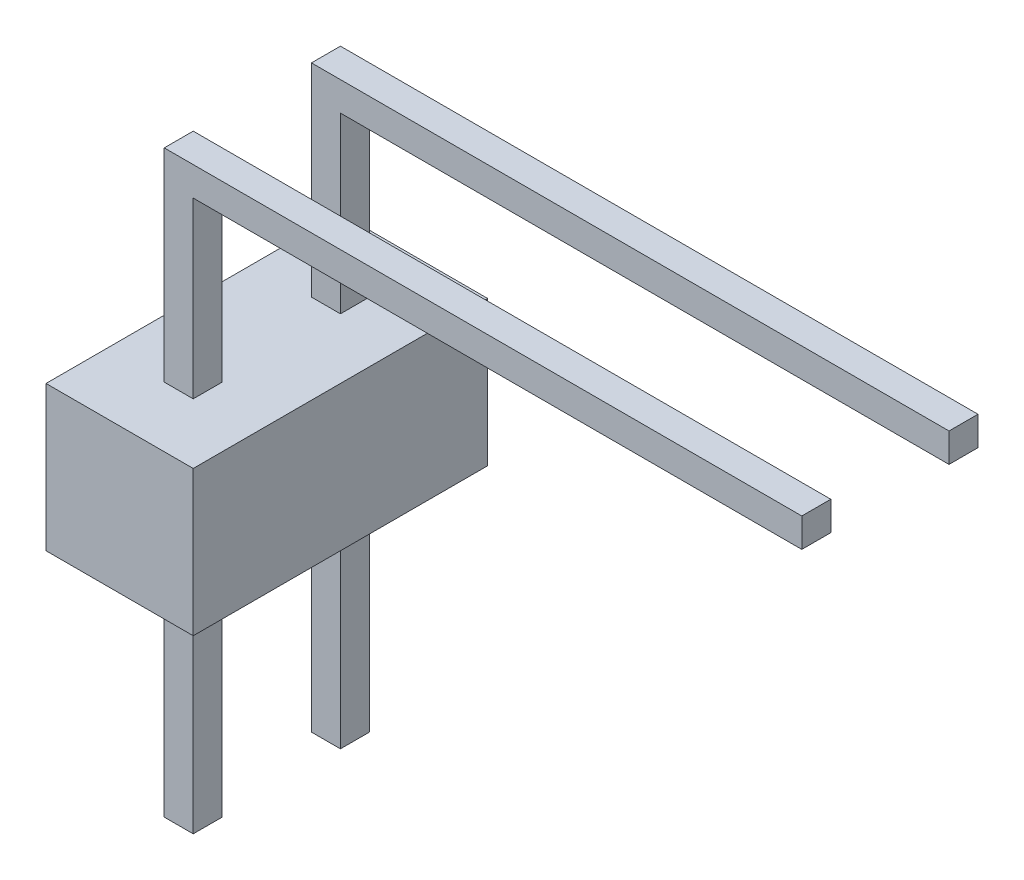
ISO-10303-21;
HEADER;
FILE_DESCRIPTION(('STEP AP214'),'2;1');
FILE_NAME('part.step','',(''),(''),'','','');
FILE_SCHEMA(('AUTOMOTIVE_DESIGN { 1 0 10303 214 1 1 1 1 }'));
ENDSEC;
DATA;
#1=APPLICATION_CONTEXT('core data for automotive mechanical design processes');
#2=APPLICATION_PROTOCOL_DEFINITION('international standard','automotive_design',2000,#1);
#3=PRODUCT_CONTEXT('',#1,'mechanical');
#4=PRODUCT('Part','Part','',(#3));
#5=PRODUCT_RELATED_PRODUCT_CATEGORY('part','',(#4));
#6=PRODUCT_DEFINITION_FORMATION('','',#4);
#7=PRODUCT_DEFINITION_CONTEXT('part definition',#1,'design');
#8=PRODUCT_DEFINITION('design','',#6,#7);
#9=PRODUCT_DEFINITION_SHAPE('','',#8);
#10=(LENGTH_UNIT() NAMED_UNIT(*) SI_UNIT(.MILLI.,.METRE.));
#11=(NAMED_UNIT(*) PLANE_ANGLE_UNIT() SI_UNIT($,.RADIAN.));
#12=(NAMED_UNIT(*) SI_UNIT($,.STERADIAN.) SOLID_ANGLE_UNIT());
#13=UNCERTAINTY_MEASURE_WITH_UNIT(LENGTH_MEASURE(1.E-05),#10,'distance_accuracy_value','');
#14=(GEOMETRIC_REPRESENTATION_CONTEXT(3) GLOBAL_UNCERTAINTY_ASSIGNED_CONTEXT((#13)) GLOBAL_UNIT_ASSIGNED_CONTEXT((#10,
#11,#12)) REPRESENTATION_CONTEXT('',''));
#15=CARTESIAN_POINT('',(0.,0.,0.));
#16=DIRECTION('',(0.,0.,1.));
#17=DIRECTION('',(1.,0.,0.));
#18=AXIS2_PLACEMENT_3D('',#15,#16,#17);
#19=CARTESIAN_POINT('',(0.5,5.5,0.5));
#20=DIRECTION('',(-1.,0.,0.));
#21=DIRECTION('',(0.,-1.,0.));
#22=AXIS2_PLACEMENT_3D('',#19,#20,#21);
#23=PLANE('',#22);
#24=DIRECTION('',(0.,1.,0.));
#25=VECTOR('',#24,1.);
#26=CARTESIAN_POINT('',(0.5,5.5,0.5));
#27=LINE('',#26,#25);
#28=CARTESIAN_POINT('',(0.500000000000001,2.5,0.5));
#29=VERTEX_POINT('',#28);
#30=CARTESIAN_POINT('',(0.5,5.5,0.5));
#31=VERTEX_POINT('',#30);
#32=EDGE_CURVE('E324',#29,#31,#27,.T.);
#33=ORIENTED_EDGE('',*,*,#32,.F.);
#34=DIRECTION('',(0.,0.,-1.));
#35=VECTOR('',#34,1.);
#36=CARTESIAN_POINT('',(0.500000000000001,2.5,0.5));
#37=LINE('',#36,#35);
#38=CARTESIAN_POINT('',(0.500000000000001,2.5,0.));
#39=VERTEX_POINT('',#38);
#40=EDGE_CURVE('E316',#29,#39,#37,.T.);
#41=ORIENTED_EDGE('',*,*,#40,.T.);
#42=DIRECTION('',(0.,1.,0.));
#43=VECTOR('',#42,1.);
#44=CARTESIAN_POINT('',(0.5,5.5,0.));
#45=LINE('',#44,#43);
#46=CARTESIAN_POINT('',(0.5,5.5,0.));
#47=VERTEX_POINT('',#46);
#48=EDGE_CURVE('E341',#39,#47,#45,.T.);
#49=ORIENTED_EDGE('',*,*,#48,.T.);
#50=DIRECTION('',(0.,0.,-1.));
#51=VECTOR('',#50,1.);
#52=CARTESIAN_POINT('',(0.5,5.5,0.5));
#53=LINE('',#52,#51);
#54=EDGE_CURVE('E364',#31,#47,#53,.T.);
#55=ORIENTED_EDGE('',*,*,#54,.F.);
#56=EDGE_LOOP('',(#33,#41,#49,#55));
#57=FACE_BOUND('',#56,.T.);
#58=ADVANCED_FACE('F32',(#57),#23,.F.);
#59=CARTESIAN_POINT('',(11.,5.5,0.5));
#60=DIRECTION('',(0.,1.,0.));
#61=DIRECTION('',(-1.,0.,0.));
#62=AXIS2_PLACEMENT_3D('',#59,#60,#61);
#63=PLANE('',#62);
#64=DIRECTION('',(1.,0.,0.));
#65=VECTOR('',#64,1.);
#66=CARTESIAN_POINT('',(11.,5.5,0.));
#67=LINE('',#66,#65);
#68=CARTESIAN_POINT('',(11.,5.5,0.));
#69=VERTEX_POINT('',#68);
#70=EDGE_CURVE('E345',#47,#69,#67,.T.);
#71=ORIENTED_EDGE('',*,*,#70,.T.);
#72=DIRECTION('',(0.,0.,-1.));
#73=VECTOR('',#72,1.);
#74=CARTESIAN_POINT('',(11.,5.5,0.5));
#75=LINE('',#74,#73);
#76=CARTESIAN_POINT('',(11.,5.5,0.5));
#77=VERTEX_POINT('',#76);
#78=EDGE_CURVE('E361',#77,#69,#75,.T.);
#79=ORIENTED_EDGE('',*,*,#78,.F.);
#80=DIRECTION('',(1.,0.,0.));
#81=VECTOR('',#80,1.);
#82=CARTESIAN_POINT('',(11.,5.5,0.5));
#83=LINE('',#82,#81);
#84=EDGE_CURVE('E329',#31,#77,#83,.T.);
#85=ORIENTED_EDGE('',*,*,#84,.F.);
#86=ORIENTED_EDGE('',*,*,#54,.T.);
#87=EDGE_LOOP('',(#71,#79,#85,#86));
#88=FACE_BOUND('',#87,.T.);
#89=ADVANCED_FACE('F405',(#88),#63,.F.);
#90=CARTESIAN_POINT('',(11.,6.,0.5));
#91=DIRECTION('',(-1.,0.,0.));
#92=DIRECTION('',(0.,0.,1.));
#93=AXIS2_PLACEMENT_3D('',#90,#91,#92);
#94=PLANE('',#93);
#95=DIRECTION('',(0.,1.,0.));
#96=VECTOR('',#95,1.);
#97=CARTESIAN_POINT('',(11.,6.,0.));
#98=LINE('',#97,#96);
#99=CARTESIAN_POINT('',(11.,6.,0.));
#100=VERTEX_POINT('',#99);
#101=EDGE_CURVE('E347',#69,#100,#98,.T.);
#102=ORIENTED_EDGE('',*,*,#101,.T.);
#103=DIRECTION('',(0.,0.,-1.));
#104=VECTOR('',#103,1.);
#105=CARTESIAN_POINT('',(11.,6.,0.5));
#106=LINE('',#105,#104);
#107=CARTESIAN_POINT('',(11.,6.,0.5));
#108=VERTEX_POINT('',#107);
#109=EDGE_CURVE('E358',#108,#100,#106,.T.);
#110=ORIENTED_EDGE('',*,*,#109,.F.);
#111=DIRECTION('',(0.,1.,0.));
#112=VECTOR('',#111,1.);
#113=CARTESIAN_POINT('',(11.,6.,0.5));
#114=LINE('',#113,#112);
#115=EDGE_CURVE('E331',#77,#108,#114,.T.);
#116=ORIENTED_EDGE('',*,*,#115,.F.);
#117=ORIENTED_EDGE('',*,*,#78,.T.);
#118=EDGE_LOOP('',(#102,#110,#116,#117));
#119=FACE_BOUND('',#118,.T.);
#120=ADVANCED_FACE('F410',(#119),#94,.F.);
#121=CARTESIAN_POINT('',(0.,6.,0.5));
#122=DIRECTION('',(0.,-1.,0.));
#123=DIRECTION('',(0.,0.,-1.));
#124=AXIS2_PLACEMENT_3D('',#121,#122,#123);
#125=PLANE('',#124);
#126=DIRECTION('',(-1.,0.,0.));
#127=VECTOR('',#126,1.);
#128=CARTESIAN_POINT('',(0.,6.,0.));
#129=LINE('',#128,#127);
#130=CARTESIAN_POINT('',(0.,6.,0.));
#131=VERTEX_POINT('',#130);
#132=EDGE_CURVE('E349',#100,#131,#129,.T.);
#133=ORIENTED_EDGE('',*,*,#132,.T.);
#134=DIRECTION('',(0.,0.,-1.));
#135=VECTOR('',#134,1.);
#136=CARTESIAN_POINT('',(0.,6.,0.5));
#137=LINE('',#136,#135);
#138=CARTESIAN_POINT('',(0.,6.,0.5));
#139=VERTEX_POINT('',#138);
#140=EDGE_CURVE('E355',#139,#131,#137,.T.);
#141=ORIENTED_EDGE('',*,*,#140,.F.);
#142=DIRECTION('',(-1.,0.,0.));
#143=VECTOR('',#142,1.);
#144=CARTESIAN_POINT('',(0.,6.,0.5));
#145=LINE('',#144,#143);
#146=EDGE_CURVE('E333',#108,#139,#145,.T.);
#147=ORIENTED_EDGE('',*,*,#146,.F.);
#148=ORIENTED_EDGE('',*,*,#109,.T.);
#149=EDGE_LOOP('',(#133,#141,#147,#148));
#150=FACE_BOUND('',#149,.T.);
#151=ADVANCED_FACE('F428',(#150),#125,.F.);
#152=CARTESIAN_POINT('',(0.,-4.,0.5));
#153=DIRECTION('',(1.,0.,0.));
#154=DIRECTION('',(0.,0.,-1.));
#155=AXIS2_PLACEMENT_3D('',#152,#153,#154);
#156=PLANE('',#155);
#157=DIRECTION('',(0.,-1.,0.));
#158=VECTOR('',#157,1.);
#159=CARTESIAN_POINT('',(0.,-4.,0.));
#160=LINE('',#159,#158);
#161=CARTESIAN_POINT('',(0.,2.5,0.));
#162=VERTEX_POINT('',#161);
#163=EDGE_CURVE('E325',#131,#162,#160,.T.);
#164=ORIENTED_EDGE('',*,*,#163,.T.);
#165=DIRECTION('',(0.,0.,1.));
#166=VECTOR('',#165,1.);
#167=CARTESIAN_POINT('',(0.,2.5,0.5));
#168=LINE('',#167,#166);
#169=CARTESIAN_POINT('',(0.,2.5,0.5));
#170=VERTEX_POINT('',#169);
#171=EDGE_CURVE('E47',#162,#170,#168,.T.);
#172=ORIENTED_EDGE('',*,*,#171,.T.);
#173=DIRECTION('',(0.,-1.,0.));
#174=VECTOR('',#173,1.);
#175=CARTESIAN_POINT('',(0.,-4.,0.5));
#176=LINE('',#175,#174);
#177=EDGE_CURVE('E336',#139,#170,#176,.T.);
#178=ORIENTED_EDGE('',*,*,#177,.F.);
#179=ORIENTED_EDGE('',*,*,#140,.T.);
#180=EDGE_LOOP('',(#164,#172,#178,#179));
#181=FACE_BOUND('',#180,.T.);
#182=ADVANCED_FACE('F403',(#181),#156,.F.);
#183=CARTESIAN_POINT('',(0.,0.,0.5));
#184=DIRECTION('',(0.,0.,-1.));
#185=DIRECTION('',(-1.,0.,0.));
#186=AXIS2_PLACEMENT_3D('',#183,#184,#185);
#187=PLANE('',#186);
#188=ORIENTED_EDGE('',*,*,#177,.T.);
#189=DIRECTION('',(1.,0.,0.));
#190=VECTOR('',#189,1.);
#191=CARTESIAN_POINT('',(0.,2.5,0.5));
#192=LINE('',#191,#190);
#193=EDGE_CURVE('E54',#170,#29,#192,.T.);
#194=ORIENTED_EDGE('',*,*,#193,.T.);
#195=ORIENTED_EDGE('',*,*,#32,.T.);
#196=ORIENTED_EDGE('',*,*,#84,.T.);
#197=ORIENTED_EDGE('',*,*,#115,.T.);
#198=ORIENTED_EDGE('',*,*,#146,.T.);
#199=EDGE_LOOP('',(#188,#194,#195,#196,#197,#198));
#200=FACE_BOUND('',#199,.T.);
#201=ADVANCED_FACE('F393',(#200),#187,.F.);
#202=CARTESIAN_POINT('',(0.,0.,0.));
#203=DIRECTION('',(0.,0.,-1.));
#204=DIRECTION('',(-1.,0.,0.));
#205=AXIS2_PLACEMENT_3D('',#202,#203,#204);
#206=PLANE('',#205);
#207=DIRECTION('',(1.,0.,0.));
#208=VECTOR('',#207,1.);
#209=CARTESIAN_POINT('',(0.,2.5,0.));
#210=LINE('',#209,#208);
#211=EDGE_CURVE('E11',#162,#39,#210,.T.);
#212=ORIENTED_EDGE('',*,*,#211,.F.);
#213=ORIENTED_EDGE('',*,*,#163,.F.);
#214=ORIENTED_EDGE('',*,*,#132,.F.);
#215=ORIENTED_EDGE('',*,*,#101,.F.);
#216=ORIENTED_EDGE('',*,*,#70,.F.);
#217=ORIENTED_EDGE('',*,*,#48,.F.);
#218=EDGE_LOOP('',(#212,#213,#214,#215,#216,#217));
#219=FACE_BOUND('',#218,.T.);
#220=ADVANCED_FACE('F399',(#219),#206,.T.);
#221=CARTESIAN_POINT('',(0.,2.5,0.));
#222=DIRECTION('',(0.,1.,0.));
#223=DIRECTION('',(0.,0.,1.));
#224=AXIS2_PLACEMENT_3D('',#221,#222,#223);
#225=PLANE('',#224);
#226=DIRECTION('',(0.,0.,1.));
#227=VECTOR('',#226,1.);
#228=CARTESIAN_POINT('',(-1.,2.5,-1.));
#229=LINE('',#228,#227);
#230=CARTESIAN_POINT('',(-1.,2.5,-1.));
#231=VERTEX_POINT('',#230);
#232=CARTESIAN_POINT('',(-1.,2.5,4.08));
#233=VERTEX_POINT('',#232);
#234=EDGE_CURVE('E195',#231,#233,#229,.T.);
#235=ORIENTED_EDGE('',*,*,#234,.T.);
#236=DIRECTION('',(1.,0.,0.));
#237=VECTOR('',#236,1.);
#238=CARTESIAN_POINT('',(-1.,2.5,4.08));
#239=LINE('',#238,#237);
#240=CARTESIAN_POINT('',(1.54,2.5,4.08));
#241=VERTEX_POINT('',#240);
#242=EDGE_CURVE('E199',#233,#241,#239,.T.);
#243=ORIENTED_EDGE('',*,*,#242,.T.);
#244=DIRECTION('',(0.,0.,-1.));
#245=VECTOR('',#244,1.);
#246=CARTESIAN_POINT('',(1.54,2.5,-1.));
#247=LINE('',#246,#245);
#248=CARTESIAN_POINT('',(1.54,2.5,-1.));
#249=VERTEX_POINT('',#248);
#250=EDGE_CURVE('E207',#241,#249,#247,.T.);
#251=ORIENTED_EDGE('',*,*,#250,.T.);
#252=DIRECTION('',(-1.,0.,0.));
#253=VECTOR('',#252,1.);
#254=CARTESIAN_POINT('',(-1.,2.5,-1.));
#255=LINE('',#254,#253);
#256=EDGE_CURVE('E202',#249,#231,#255,.T.);
#257=ORIENTED_EDGE('',*,*,#256,.T.);
#258=EDGE_LOOP('',(#235,#243,#251,#257));
#259=FACE_BOUND('',#258,.T.);
#260=ORIENTED_EDGE('',*,*,#193,.F.);
#261=ORIENTED_EDGE('',*,*,#171,.F.);
#262=ORIENTED_EDGE('',*,*,#211,.T.);
#263=ORIENTED_EDGE('',*,*,#40,.F.);
#264=EDGE_LOOP('',(#260,#261,#262,#263));
#265=FACE_BOUND('',#264,.T.);
#266=DIRECTION('',(1.,0.,0.));
#267=VECTOR('',#266,1.);
#268=CARTESIAN_POINT('',(0.,2.5,3.04));
#269=LINE('',#268,#267);
#270=CARTESIAN_POINT('',(0.,2.5,3.04));
#271=VERTEX_POINT('',#270);
#272=CARTESIAN_POINT('',(0.500000000000001,2.5,3.04));
#273=VERTEX_POINT('',#272);
#274=EDGE_CURVE('E238',#271,#273,#269,.T.);
#275=ORIENTED_EDGE('',*,*,#274,.F.);
#276=DIRECTION('',(0.,0.,1.));
#277=VECTOR('',#276,1.);
#278=CARTESIAN_POINT('',(0.,2.5,3.04));
#279=LINE('',#278,#277);
#280=CARTESIAN_POINT('',(0.,2.5,2.54));
#281=VERTEX_POINT('',#280);
#282=EDGE_CURVE('E233',#281,#271,#279,.T.);
#283=ORIENTED_EDGE('',*,*,#282,.F.);
#284=DIRECTION('',(1.,0.,0.));
#285=VECTOR('',#284,1.);
#286=CARTESIAN_POINT('',(0.,2.5,2.54));
#287=LINE('',#286,#285);
#288=CARTESIAN_POINT('',(0.500000000000001,2.5,2.54));
#289=VERTEX_POINT('',#288);
#290=EDGE_CURVE('E295',#281,#289,#287,.T.);
#291=ORIENTED_EDGE('',*,*,#290,.T.);
#292=DIRECTION('',(0.,0.,-1.));
#293=VECTOR('',#292,1.);
#294=CARTESIAN_POINT('',(0.500000000000001,2.5,3.04));
#295=LINE('',#294,#293);
#296=EDGE_CURVE('E235',#273,#289,#295,.T.);
#297=ORIENTED_EDGE('',*,*,#296,.F.);
#298=EDGE_LOOP('',(#275,#283,#291,#297));
#299=FACE_BOUND('',#298,.T.);
#300=ADVANCED_FACE('F197',(#259,#265,#299),#225,.T.);
#301=CARTESIAN_POINT('',(0.,0.,0.));
#302=DIRECTION('',(0.,1.,0.));
#303=DIRECTION('',(0.,0.,1.));
#304=AXIS2_PLACEMENT_3D('',#301,#302,#303);
#305=PLANE('',#304);
#306=DIRECTION('',(0.,0.,1.));
#307=VECTOR('',#306,1.);
#308=CARTESIAN_POINT('',(-1.,0.,-1.));
#309=LINE('',#308,#307);
#310=CARTESIAN_POINT('',(-1.,0.,-1.));
#311=VERTEX_POINT('',#310);
#312=CARTESIAN_POINT('',(-1.,0.,4.08));
#313=VERTEX_POINT('',#312);
#314=EDGE_CURVE('E221',#311,#313,#309,.T.);
#315=ORIENTED_EDGE('',*,*,#314,.F.);
#316=DIRECTION('',(-1.,0.,0.));
#317=VECTOR('',#316,1.);
#318=CARTESIAN_POINT('',(-1.,0.,-1.));
#319=LINE('',#318,#317);
#320=CARTESIAN_POINT('',(1.54,0.,-1.));
#321=VERTEX_POINT('',#320);
#322=EDGE_CURVE('E208',#321,#311,#319,.T.);
#323=ORIENTED_EDGE('',*,*,#322,.F.);
#324=DIRECTION('',(0.,0.,-1.));
#325=VECTOR('',#324,1.);
#326=CARTESIAN_POINT('',(1.54,0.,-1.));
#327=LINE('',#326,#325);
#328=CARTESIAN_POINT('',(1.54,0.,4.08));
#329=VERTEX_POINT('',#328);
#330=EDGE_CURVE('E302',#329,#321,#327,.T.);
#331=ORIENTED_EDGE('',*,*,#330,.F.);
#332=DIRECTION('',(1.,0.,0.));
#333=VECTOR('',#332,1.);
#334=CARTESIAN_POINT('',(-1.,0.,4.08));
#335=LINE('',#334,#333);
#336=EDGE_CURVE('E217',#313,#329,#335,.T.);
#337=ORIENTED_EDGE('',*,*,#336,.F.);
#338=EDGE_LOOP('',(#315,#323,#331,#337));
#339=FACE_BOUND('',#338,.T.);
#340=DIRECTION('',(0.,0.,1.));
#341=VECTOR('',#340,1.);
#342=CARTESIAN_POINT('',(0.,0.,0.5));
#343=LINE('',#342,#341);
#344=CARTESIAN_POINT('',(0.,0.,0.));
#345=VERTEX_POINT('',#344);
#346=CARTESIAN_POINT('',(0.,0.,0.5));
#347=VERTEX_POINT('',#346);
#348=EDGE_CURVE('E309',#345,#347,#343,.T.);
#349=ORIENTED_EDGE('',*,*,#348,.T.);
#350=DIRECTION('',(1.,0.,0.));
#351=VECTOR('',#350,1.);
#352=CARTESIAN_POINT('',(0.,0.,0.5));
#353=LINE('',#352,#351);
#354=CARTESIAN_POINT('',(0.500000000000001,0.,0.5));
#355=VERTEX_POINT('',#354);
#356=EDGE_CURVE('E313',#347,#355,#353,.T.);
#357=ORIENTED_EDGE('',*,*,#356,.T.);
#358=DIRECTION('',(0.,0.,-1.));
#359=VECTOR('',#358,1.);
#360=CARTESIAN_POINT('',(0.500000000000001,0.,0.5));
#361=LINE('',#360,#359);
#362=CARTESIAN_POINT('',(0.500000000000001,0.,0.));
#363=VERTEX_POINT('',#362);
#364=EDGE_CURVE('E311',#355,#363,#361,.T.);
#365=ORIENTED_EDGE('',*,*,#364,.T.);
#366=DIRECTION('',(1.,0.,0.));
#367=VECTOR('',#366,1.);
#368=CARTESIAN_POINT('',(0.,0.,0.));
#369=LINE('',#368,#367);
#370=EDGE_CURVE('E40',#345,#363,#369,.T.);
#371=ORIENTED_EDGE('',*,*,#370,.F.);
#372=EDGE_LOOP('',(#349,#357,#365,#371));
#373=FACE_BOUND('',#372,.T.);
#374=DIRECTION('',(0.,0.,1.));
#375=VECTOR('',#374,1.);
#376=CARTESIAN_POINT('',(0.,0.,3.04));
#377=LINE('',#376,#375);
#378=CARTESIAN_POINT('',(0.,0.,2.54));
#379=VERTEX_POINT('',#378);
#380=CARTESIAN_POINT('',(0.,0.,3.04));
#381=VERTEX_POINT('',#380);
#382=EDGE_CURVE('E223',#379,#381,#377,.T.);
#383=ORIENTED_EDGE('',*,*,#382,.T.);
#384=DIRECTION('',(1.,0.,0.));
#385=VECTOR('',#384,1.);
#386=CARTESIAN_POINT('',(0.,0.,3.04));
#387=LINE('',#386,#385);
#388=CARTESIAN_POINT('',(0.500000000000001,0.,3.04));
#389=VERTEX_POINT('',#388);
#390=EDGE_CURVE('E231',#381,#389,#387,.T.);
#391=ORIENTED_EDGE('',*,*,#390,.T.);
#392=DIRECTION('',(0.,0.,-1.));
#393=VECTOR('',#392,1.);
#394=CARTESIAN_POINT('',(0.500000000000001,0.,3.04));
#395=LINE('',#394,#393);
#396=CARTESIAN_POINT('',(0.500000000000001,0.,2.54));
#397=VERTEX_POINT('',#396);
#398=EDGE_CURVE('E225',#389,#397,#395,.T.);
#399=ORIENTED_EDGE('',*,*,#398,.T.);
#400=DIRECTION('',(1.,0.,0.));
#401=VECTOR('',#400,1.);
#402=CARTESIAN_POINT('',(0.,0.,2.54));
#403=LINE('',#402,#401);
#404=EDGE_CURVE('E292',#379,#397,#403,.T.);
#405=ORIENTED_EDGE('',*,*,#404,.F.);
#406=EDGE_LOOP('',(#383,#391,#399,#405));
#407=FACE_BOUND('',#406,.T.);
#408=ADVANCED_FACE('F387',(#339,#373,#407),#305,.F.);
#409=CARTESIAN_POINT('',(-1.,2.5,-1.));
#410=DIRECTION('',(1.,0.,0.));
#411=DIRECTION('',(0.,0.,-1.));
#412=AXIS2_PLACEMENT_3D('',#409,#410,#411);
#413=PLANE('',#412);
#414=ORIENTED_EDGE('',*,*,#314,.T.);
#415=DIRECTION('',(0.,-1.,0.));
#416=VECTOR('',#415,1.);
#417=CARTESIAN_POINT('',(-1.,2.5,4.08));
#418=LINE('',#417,#416);
#419=EDGE_CURVE('E214',#233,#313,#418,.T.);
#420=ORIENTED_EDGE('',*,*,#419,.F.);
#421=ORIENTED_EDGE('',*,*,#234,.F.);
#422=DIRECTION('',(0.,-1.,0.));
#423=VECTOR('',#422,1.);
#424=CARTESIAN_POINT('',(-1.,2.5,-1.));
#425=LINE('',#424,#423);
#426=EDGE_CURVE('E300',#231,#311,#425,.T.);
#427=ORIENTED_EDGE('',*,*,#426,.T.);
#428=EDGE_LOOP('',(#414,#420,#421,#427));
#429=FACE_BOUND('',#428,.T.);
#430=ADVANCED_FACE('F219',(#429),#413,.F.);
#431=CARTESIAN_POINT('',(1.54,2.5,-1.));
#432=DIRECTION('',(-1.,0.,0.));
#433=DIRECTION('',(0.,0.,1.));
#434=AXIS2_PLACEMENT_3D('',#431,#432,#433);
#435=PLANE('',#434);
#436=ORIENTED_EDGE('',*,*,#330,.T.);
#437=DIRECTION('',(0.,-1.,0.));
#438=VECTOR('',#437,1.);
#439=CARTESIAN_POINT('',(1.54,2.5,-1.));
#440=LINE('',#439,#438);
#441=EDGE_CURVE('E306',#249,#321,#440,.T.);
#442=ORIENTED_EDGE('',*,*,#441,.F.);
#443=ORIENTED_EDGE('',*,*,#250,.F.);
#444=DIRECTION('',(0.,-1.,0.));
#445=VECTOR('',#444,1.);
#446=CARTESIAN_POINT('',(1.54,2.5,4.08));
#447=LINE('',#446,#445);
#448=EDGE_CURVE('E216',#241,#329,#447,.T.);
#449=ORIENTED_EDGE('',*,*,#448,.T.);
#450=EDGE_LOOP('',(#436,#442,#443,#449));
#451=FACE_BOUND('',#450,.T.);
#452=ADVANCED_FACE('F463',(#451),#435,.F.);
#453=CARTESIAN_POINT('',(-1.,2.5,-1.));
#454=DIRECTION('',(0.,0.,1.));
#455=DIRECTION('',(1.,0.,0.));
#456=AXIS2_PLACEMENT_3D('',#453,#454,#455);
#457=PLANE('',#456);
#458=ORIENTED_EDGE('',*,*,#322,.T.);
#459=ORIENTED_EDGE('',*,*,#426,.F.);
#460=ORIENTED_EDGE('',*,*,#256,.F.);
#461=ORIENTED_EDGE('',*,*,#441,.T.);
#462=EDGE_LOOP('',(#458,#459,#460,#461));
#463=FACE_BOUND('',#462,.T.);
#464=ADVANCED_FACE('F400',(#463),#457,.F.);
#465=CARTESIAN_POINT('',(0.500000000000001,-4.,0.5));
#466=DIRECTION('',(0.,1.,0.));
#467=DIRECTION('',(0.,0.,1.));
#468=AXIS2_PLACEMENT_3D('',#465,#466,#467);
#469=PLANE('',#468);
#470=DIRECTION('',(1.,0.,0.));
#471=VECTOR('',#470,1.);
#472=CARTESIAN_POINT('',(0.500000000000001,-4.,0.));
#473=LINE('',#472,#471);
#474=CARTESIAN_POINT('',(0.,-4.,0.));
#475=VERTEX_POINT('',#474);
#476=CARTESIAN_POINT('',(0.500000000000001,-4.,0.));
#477=VERTEX_POINT('',#476);
#478=EDGE_CURVE('E320',#475,#477,#473,.T.);
#479=ORIENTED_EDGE('',*,*,#478,.T.);
#480=DIRECTION('',(0.,0.,-1.));
#481=VECTOR('',#480,1.);
#482=CARTESIAN_POINT('',(0.500000000000001,-4.,0.5));
#483=LINE('',#482,#481);
#484=CARTESIAN_POINT('',(0.500000000000001,-4.,0.5));
#485=VERTEX_POINT('',#484);
#486=EDGE_CURVE('E367',#485,#477,#483,.T.);
#487=ORIENTED_EDGE('',*,*,#486,.F.);
#488=DIRECTION('',(1.,0.,0.));
#489=VECTOR('',#488,1.);
#490=CARTESIAN_POINT('',(0.500000000000001,-4.,0.5));
#491=LINE('',#490,#489);
#492=CARTESIAN_POINT('',(0.,-4.,0.5));
#493=VERTEX_POINT('',#492);
#494=EDGE_CURVE('E321',#493,#485,#491,.T.);
#495=ORIENTED_EDGE('',*,*,#494,.F.);
#496=DIRECTION('',(0.,0.,-1.));
#497=VECTOR('',#496,1.);
#498=CARTESIAN_POINT('',(0.,-4.,0.5));
#499=LINE('',#498,#497);
#500=EDGE_CURVE('E338',#493,#475,#499,.T.);
#501=ORIENTED_EDGE('',*,*,#500,.T.);
#502=EDGE_LOOP('',(#479,#487,#495,#501));
#503=FACE_BOUND('',#502,.T.);
#504=ADVANCED_FACE('F34',(#503),#469,.F.);
#505=ORIENTED_EDGE('',*,*,#356,.F.);
#506=EDGE_CURVE('E335',#347,#493,#176,.T.);
#507=ORIENTED_EDGE('',*,*,#506,.T.);
#508=ORIENTED_EDGE('',*,*,#494,.T.);
#509=EDGE_CURVE('E326',#485,#355,#27,.T.);
#510=ORIENTED_EDGE('',*,*,#509,.T.);
#511=EDGE_LOOP('',(#505,#507,#508,#510));
#512=FACE_BOUND('',#511,.T.);
#513=ADVANCED_FACE('F390',(#512),#187,.F.);
#514=EDGE_CURVE('E351',#345,#475,#160,.T.);
#515=ORIENTED_EDGE('',*,*,#514,.F.);
#516=ORIENTED_EDGE('',*,*,#370,.T.);
#517=EDGE_CURVE('E342',#477,#363,#45,.T.);
#518=ORIENTED_EDGE('',*,*,#517,.F.);
#519=ORIENTED_EDGE('',*,*,#478,.F.);
#520=EDGE_LOOP('',(#515,#516,#518,#519));
#521=FACE_BOUND('',#520,.T.);
#522=ADVANCED_FACE('F372',(#521),#206,.T.);
#523=ORIENTED_EDGE('',*,*,#348,.F.);
#524=ORIENTED_EDGE('',*,*,#514,.T.);
#525=ORIENTED_EDGE('',*,*,#500,.F.);
#526=ORIENTED_EDGE('',*,*,#506,.F.);
#527=EDGE_LOOP('',(#523,#524,#525,#526));
#528=FACE_BOUND('',#527,.T.);
#529=ADVANCED_FACE('F385',(#528),#156,.F.);
#530=ORIENTED_EDGE('',*,*,#364,.F.);
#531=ORIENTED_EDGE('',*,*,#509,.F.);
#532=ORIENTED_EDGE('',*,*,#486,.T.);
#533=ORIENTED_EDGE('',*,*,#517,.T.);
#534=EDGE_LOOP('',(#530,#531,#532,#533));
#535=FACE_BOUND('',#534,.T.);
#536=ADVANCED_FACE('F378',(#535),#23,.F.);
#537=CARTESIAN_POINT('',(0.5,5.5,3.04));
#538=DIRECTION('',(-1.,0.,0.));
#539=DIRECTION('',(0.,-1.,0.));
#540=AXIS2_PLACEMENT_3D('',#537,#538,#539);
#541=PLANE('',#540);
#542=DIRECTION('',(0.,1.,0.));
#543=VECTOR('',#542,1.);
#544=CARTESIAN_POINT('',(0.5,5.5,3.04));
#545=LINE('',#544,#543);
#546=CARTESIAN_POINT('',(0.5,5.5,3.04));
#547=VERTEX_POINT('',#546);
#548=EDGE_CURVE('E244',#273,#547,#545,.T.);
#549=ORIENTED_EDGE('',*,*,#548,.F.);
#550=ORIENTED_EDGE('',*,*,#296,.T.);
#551=DIRECTION('',(0.,1.,0.));
#552=VECTOR('',#551,1.);
#553=CARTESIAN_POINT('',(0.5,5.5,2.54));
#554=LINE('',#553,#552);
#555=CARTESIAN_POINT('',(0.5,5.5,2.54));
#556=VERTEX_POINT('',#555);
#557=EDGE_CURVE('E262',#289,#556,#554,.T.);
#558=ORIENTED_EDGE('',*,*,#557,.T.);
#559=DIRECTION('',(0.,0.,-1.));
#560=VECTOR('',#559,1.);
#561=CARTESIAN_POINT('',(0.5,5.5,3.04));
#562=LINE('',#561,#560);
#563=EDGE_CURVE('E286',#547,#556,#562,.T.);
#564=ORIENTED_EDGE('',*,*,#563,.F.);
#565=EDGE_LOOP('',(#549,#550,#558,#564));
#566=FACE_BOUND('',#565,.T.);
#567=ADVANCED_FACE('F414',(#566),#541,.F.);
#568=CARTESIAN_POINT('',(11.,5.5,3.04));
#569=DIRECTION('',(0.,1.,0.));
#570=DIRECTION('',(-1.,0.,0.));
#571=AXIS2_PLACEMENT_3D('',#568,#569,#570);
#572=PLANE('',#571);
#573=DIRECTION('',(1.,0.,0.));
#574=VECTOR('',#573,1.);
#575=CARTESIAN_POINT('',(11.,5.5,2.54));
#576=LINE('',#575,#574);
#577=CARTESIAN_POINT('',(11.,5.5,2.54));
#578=VERTEX_POINT('',#577);
#579=EDGE_CURVE('E266',#556,#578,#576,.T.);
#580=ORIENTED_EDGE('',*,*,#579,.T.);
#581=DIRECTION('',(0.,0.,-1.));
#582=VECTOR('',#581,1.);
#583=CARTESIAN_POINT('',(11.,5.5,3.04));
#584=LINE('',#583,#582);
#585=CARTESIAN_POINT('',(11.,5.5,3.04));
#586=VERTEX_POINT('',#585);
#587=EDGE_CURVE('E283',#586,#578,#584,.T.);
#588=ORIENTED_EDGE('',*,*,#587,.F.);
#589=DIRECTION('',(1.,0.,0.));
#590=VECTOR('',#589,1.);
#591=CARTESIAN_POINT('',(11.,5.5,3.04));
#592=LINE('',#591,#590);
#593=EDGE_CURVE('E249',#547,#586,#592,.T.);
#594=ORIENTED_EDGE('',*,*,#593,.F.);
#595=ORIENTED_EDGE('',*,*,#563,.T.);
#596=EDGE_LOOP('',(#580,#588,#594,#595));
#597=FACE_BOUND('',#596,.T.);
#598=ADVANCED_FACE('F419',(#597),#572,.F.);
#599=CARTESIAN_POINT('',(11.,6.,3.04));
#600=DIRECTION('',(-1.,0.,0.));
#601=DIRECTION('',(0.,0.,1.));
#602=AXIS2_PLACEMENT_3D('',#599,#600,#601);
#603=PLANE('',#602);
#604=DIRECTION('',(0.,1.,0.));
#605=VECTOR('',#604,1.);
#606=CARTESIAN_POINT('',(11.,6.,2.54));
#607=LINE('',#606,#605);
#608=CARTESIAN_POINT('',(11.,6.,2.54));
#609=VERTEX_POINT('',#608);
#610=EDGE_CURVE('E268',#578,#609,#607,.T.);
#611=ORIENTED_EDGE('',*,*,#610,.T.);
#612=DIRECTION('',(0.,0.,-1.));
#613=VECTOR('',#612,1.);
#614=CARTESIAN_POINT('',(11.,6.,3.04));
#615=LINE('',#614,#613);
#616=CARTESIAN_POINT('',(11.,6.,3.04));
#617=VERTEX_POINT('',#616);
#618=EDGE_CURVE('E280',#617,#609,#615,.T.);
#619=ORIENTED_EDGE('',*,*,#618,.F.);
#620=DIRECTION('',(0.,1.,0.));
#621=VECTOR('',#620,1.);
#622=CARTESIAN_POINT('',(11.,6.,3.04));
#623=LINE('',#622,#621);
#624=EDGE_CURVE('E251',#586,#617,#623,.T.);
#625=ORIENTED_EDGE('',*,*,#624,.F.);
#626=ORIENTED_EDGE('',*,*,#587,.T.);
#627=EDGE_LOOP('',(#611,#619,#625,#626));
#628=FACE_BOUND('',#627,.T.);
#629=ADVANCED_FACE('F568',(#628),#603,.F.);
#630=CARTESIAN_POINT('',(0.,6.,3.04));
#631=DIRECTION('',(0.,-1.,0.));
#632=DIRECTION('',(0.,0.,-1.));
#633=AXIS2_PLACEMENT_3D('',#630,#631,#632);
#634=PLANE('',#633);
#635=DIRECTION('',(-1.,0.,0.));
#636=VECTOR('',#635,1.);
#637=CARTESIAN_POINT('',(0.,6.,2.54));
#638=LINE('',#637,#636);
#639=CARTESIAN_POINT('',(0.,6.,2.54));
#640=VERTEX_POINT('',#639);
#641=EDGE_CURVE('E270',#609,#640,#638,.T.);
#642=ORIENTED_EDGE('',*,*,#641,.T.);
#643=DIRECTION('',(0.,0.,-1.));
#644=VECTOR('',#643,1.);
#645=CARTESIAN_POINT('',(0.,6.,3.04));
#646=LINE('',#645,#644);
#647=CARTESIAN_POINT('',(0.,6.,3.04));
#648=VERTEX_POINT('',#647);
#649=EDGE_CURVE('E277',#648,#640,#646,.T.);
#650=ORIENTED_EDGE('',*,*,#649,.F.);
#651=DIRECTION('',(-1.,0.,0.));
#652=VECTOR('',#651,1.);
#653=CARTESIAN_POINT('',(0.,6.,3.04));
#654=LINE('',#653,#652);
#655=EDGE_CURVE('E253',#617,#648,#654,.T.);
#656=ORIENTED_EDGE('',*,*,#655,.F.);
#657=ORIENTED_EDGE('',*,*,#618,.T.);
#658=EDGE_LOOP('',(#642,#650,#656,#657));
#659=FACE_BOUND('',#658,.T.);
#660=ADVANCED_FACE('F577',(#659),#634,.F.);
#661=CARTESIAN_POINT('',(0.,-4.,3.04));
#662=DIRECTION('',(1.,0.,0.));
#663=DIRECTION('',(0.,0.,-1.));
#664=AXIS2_PLACEMENT_3D('',#661,#662,#663);
#665=PLANE('',#664);
#666=DIRECTION('',(0.,-1.,0.));
#667=VECTOR('',#666,1.);
#668=CARTESIAN_POINT('',(0.,-4.,2.54));
#669=LINE('',#668,#667);
#670=EDGE_CURVE('E245',#640,#281,#669,.T.);
#671=ORIENTED_EDGE('',*,*,#670,.T.);
#672=ORIENTED_EDGE('',*,*,#282,.T.);
#673=DIRECTION('',(0.,-1.,0.));
#674=VECTOR('',#673,1.);
#675=CARTESIAN_POINT('',(0.,-4.,3.04));
#676=LINE('',#675,#674);
#677=EDGE_CURVE('E256',#648,#271,#676,.T.);
#678=ORIENTED_EDGE('',*,*,#677,.F.);
#679=ORIENTED_EDGE('',*,*,#649,.T.);
#680=EDGE_LOOP('',(#671,#672,#678,#679));
#681=FACE_BOUND('',#680,.T.);
#682=ADVANCED_FACE('F586',(#681),#665,.F.);
#683=CARTESIAN_POINT('',(0.,0.,3.04));
#684=DIRECTION('',(0.,0.,-1.));
#685=DIRECTION('',(-1.,0.,0.));
#686=AXIS2_PLACEMENT_3D('',#683,#684,#685);
#687=PLANE('',#686);
#688=ORIENTED_EDGE('',*,*,#677,.T.);
#689=ORIENTED_EDGE('',*,*,#274,.T.);
#690=ORIENTED_EDGE('',*,*,#548,.T.);
#691=ORIENTED_EDGE('',*,*,#593,.T.);
#692=ORIENTED_EDGE('',*,*,#624,.T.);
#693=ORIENTED_EDGE('',*,*,#655,.T.);
#694=EDGE_LOOP('',(#688,#689,#690,#691,#692,#693));
#695=FACE_BOUND('',#694,.T.);
#696=ADVANCED_FACE('F595',(#695),#687,.F.);
#697=CARTESIAN_POINT('',(0.,0.,2.54));
#698=DIRECTION('',(0.,0.,-1.));
#699=DIRECTION('',(-1.,0.,0.));
#700=AXIS2_PLACEMENT_3D('',#697,#698,#699);
#701=PLANE('',#700);
#702=ORIENTED_EDGE('',*,*,#290,.F.);
#703=ORIENTED_EDGE('',*,*,#670,.F.);
#704=ORIENTED_EDGE('',*,*,#641,.F.);
#705=ORIENTED_EDGE('',*,*,#610,.F.);
#706=ORIENTED_EDGE('',*,*,#579,.F.);
#707=ORIENTED_EDGE('',*,*,#557,.F.);
#708=EDGE_LOOP('',(#702,#703,#704,#705,#706,#707));
#709=FACE_BOUND('',#708,.T.);
#710=ADVANCED_FACE('F605',(#709),#701,.T.);
#711=CARTESIAN_POINT('',(-1.,2.5,4.08));
#712=DIRECTION('',(0.,0.,-1.));
#713=DIRECTION('',(-1.,0.,0.));
#714=AXIS2_PLACEMENT_3D('',#711,#712,#713);
#715=PLANE('',#714);
#716=ORIENTED_EDGE('',*,*,#336,.T.);
#717=ORIENTED_EDGE('',*,*,#448,.F.);
#718=ORIENTED_EDGE('',*,*,#242,.F.);
#719=ORIENTED_EDGE('',*,*,#419,.T.);
#720=EDGE_LOOP('',(#716,#717,#718,#719));
#721=FACE_BOUND('',#720,.T.);
#722=ADVANCED_FACE('F213',(#721),#715,.F.);
#723=CARTESIAN_POINT('',(0.500000000000001,-4.,3.04));
#724=DIRECTION('',(0.,1.,0.));
#725=DIRECTION('',(0.,0.,1.));
#726=AXIS2_PLACEMENT_3D('',#723,#724,#725);
#727=PLANE('',#726);
#728=DIRECTION('',(1.,0.,0.));
#729=VECTOR('',#728,1.);
#730=CARTESIAN_POINT('',(0.500000000000001,-4.,2.54));
#731=LINE('',#730,#729);
#732=CARTESIAN_POINT('',(0.,-4.,2.54));
#733=VERTEX_POINT('',#732);
#734=CARTESIAN_POINT('',(0.500000000000001,-4.,2.54));
#735=VERTEX_POINT('',#734);
#736=EDGE_CURVE('E240',#733,#735,#731,.T.);
#737=ORIENTED_EDGE('',*,*,#736,.T.);
#738=DIRECTION('',(0.,0.,-1.));
#739=VECTOR('',#738,1.);
#740=CARTESIAN_POINT('',(0.500000000000001,-4.,3.04));
#741=LINE('',#740,#739);
#742=CARTESIAN_POINT('',(0.500000000000001,-4.,3.04));
#743=VERTEX_POINT('',#742);
#744=EDGE_CURVE('E289',#743,#735,#741,.T.);
#745=ORIENTED_EDGE('',*,*,#744,.F.);
#746=DIRECTION('',(1.,0.,0.));
#747=VECTOR('',#746,1.);
#748=CARTESIAN_POINT('',(0.500000000000001,-4.,3.04));
#749=LINE('',#748,#747);
#750=CARTESIAN_POINT('',(0.,-4.,3.04));
#751=VERTEX_POINT('',#750);
#752=EDGE_CURVE('E241',#751,#743,#749,.T.);
#753=ORIENTED_EDGE('',*,*,#752,.F.);
#754=DIRECTION('',(0.,0.,-1.));
#755=VECTOR('',#754,1.);
#756=CARTESIAN_POINT('',(0.,-4.,3.04));
#757=LINE('',#756,#755);
#758=EDGE_CURVE('E259',#751,#733,#757,.T.);
#759=ORIENTED_EDGE('',*,*,#758,.T.);
#760=EDGE_LOOP('',(#737,#745,#753,#759));
#761=FACE_BOUND('',#760,.T.);
#762=ADVANCED_FACE('F459',(#761),#727,.F.);
#763=ORIENTED_EDGE('',*,*,#390,.F.);
#764=EDGE_CURVE('E255',#381,#751,#676,.T.);
#765=ORIENTED_EDGE('',*,*,#764,.T.);
#766=ORIENTED_EDGE('',*,*,#752,.T.);
#767=EDGE_CURVE('E246',#743,#389,#545,.T.);
#768=ORIENTED_EDGE('',*,*,#767,.T.);
#769=EDGE_LOOP('',(#763,#765,#766,#768));
#770=FACE_BOUND('',#769,.T.);
#771=ADVANCED_FACE('F608',(#770),#687,.F.);
#772=EDGE_CURVE('E272',#379,#733,#669,.T.);
#773=ORIENTED_EDGE('',*,*,#772,.F.);
#774=ORIENTED_EDGE('',*,*,#404,.T.);
#775=EDGE_CURVE('E263',#735,#397,#554,.T.);
#776=ORIENTED_EDGE('',*,*,#775,.F.);
#777=ORIENTED_EDGE('',*,*,#736,.F.);
#778=EDGE_LOOP('',(#773,#774,#776,#777));
#779=FACE_BOUND('',#778,.T.);
#780=ADVANCED_FACE('F617',(#779),#701,.T.);
#781=ORIENTED_EDGE('',*,*,#382,.F.);
#782=ORIENTED_EDGE('',*,*,#772,.T.);
#783=ORIENTED_EDGE('',*,*,#758,.F.);
#784=ORIENTED_EDGE('',*,*,#764,.F.);
#785=EDGE_LOOP('',(#781,#782,#783,#784));
#786=FACE_BOUND('',#785,.T.);
#787=ADVANCED_FACE('F598',(#786),#665,.F.);
#788=ORIENTED_EDGE('',*,*,#398,.F.);
#789=ORIENTED_EDGE('',*,*,#767,.F.);
#790=ORIENTED_EDGE('',*,*,#744,.T.);
#791=ORIENTED_EDGE('',*,*,#775,.T.);
#792=EDGE_LOOP('',(#788,#789,#790,#791));
#793=FACE_BOUND('',#792,.T.);
#794=ADVANCED_FACE('F422',(#793),#541,.F.);
#795=CLOSED_SHELL('',(#58,#89,#120,#151,#182,#201,#220,#300,#408,#430,#452,#464,#504,#513,#522,
#529,#536,#567,#598,#629,#660,#682,#696,#710,#722,#762,#771,#780,#787,#794));
#796=MANIFOLD_SOLID_BREP('B2',#795);
#797=ADVANCED_BREP_SHAPE_REPRESENTATION('',(#18,#796),#14);
#798=SHAPE_DEFINITION_REPRESENTATION(#9,#797);
ENDSEC;
END-ISO-10303-21;
